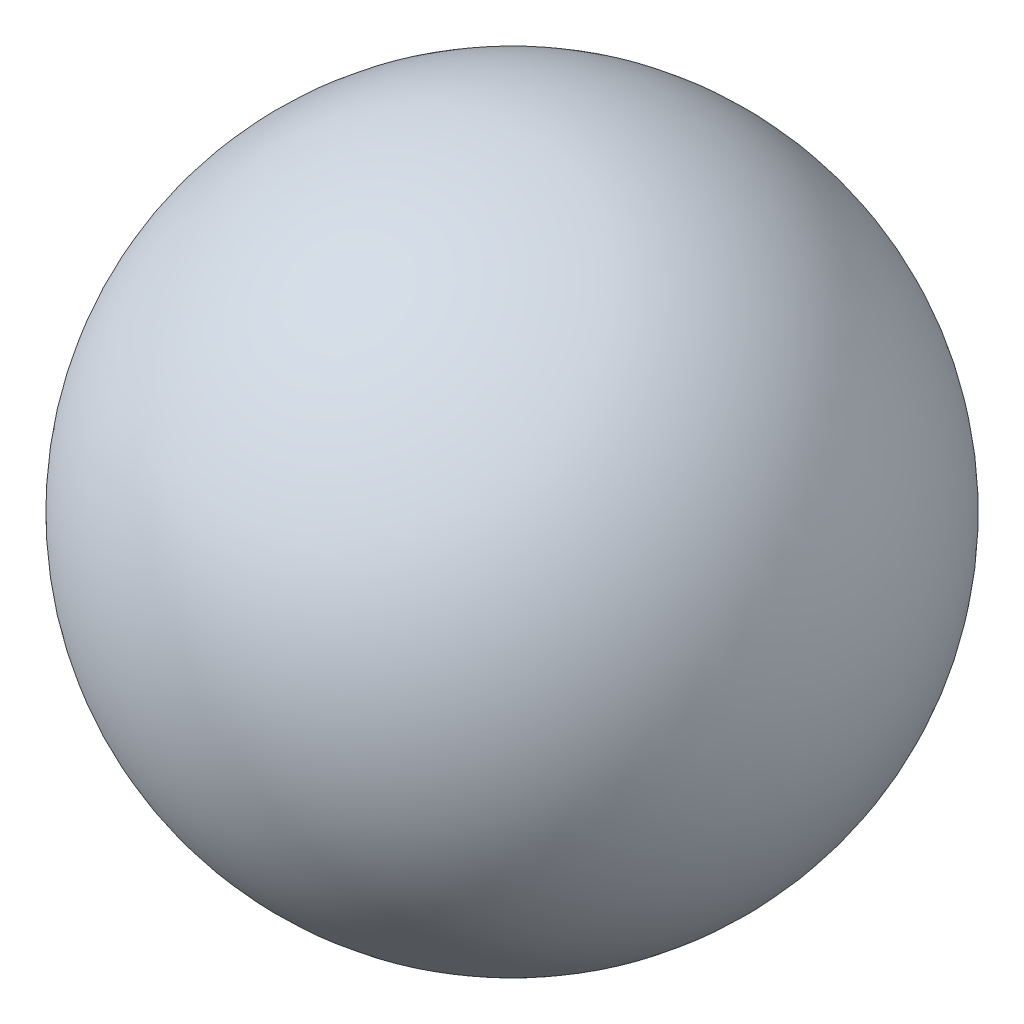
ISO-10303-21;
HEADER;
FILE_DESCRIPTION(('STEP AP214'),'2;1');
FILE_NAME('part.step','',(''),(''),'','','');
FILE_SCHEMA(('AUTOMOTIVE_DESIGN { 1 0 10303 214 1 1 1 1 }'));
ENDSEC;
DATA;
#1=APPLICATION_CONTEXT('core data for automotive mechanical design processes');
#2=APPLICATION_PROTOCOL_DEFINITION('international standard','automotive_design',2000,#1);
#3=PRODUCT_CONTEXT('',#1,'mechanical');
#4=PRODUCT('Part','Part','',(#3));
#5=PRODUCT_RELATED_PRODUCT_CATEGORY('part','',(#4));
#6=PRODUCT_DEFINITION_FORMATION('','',#4);
#7=PRODUCT_DEFINITION_CONTEXT('part definition',#1,'design');
#8=PRODUCT_DEFINITION('design','',#6,#7);
#9=PRODUCT_DEFINITION_SHAPE('','',#8);
#10=(LENGTH_UNIT() NAMED_UNIT(*) SI_UNIT(.MILLI.,.METRE.));
#11=(NAMED_UNIT(*) PLANE_ANGLE_UNIT() SI_UNIT($,.RADIAN.));
#12=(NAMED_UNIT(*) SI_UNIT($,.STERADIAN.) SOLID_ANGLE_UNIT());
#13=UNCERTAINTY_MEASURE_WITH_UNIT(LENGTH_MEASURE(1.E-05),#10,'distance_accuracy_value','');
#14=(GEOMETRIC_REPRESENTATION_CONTEXT(3) GLOBAL_UNCERTAINTY_ASSIGNED_CONTEXT((#13)) GLOBAL_UNIT_ASSIGNED_CONTEXT((#10,
#11,#12)) REPRESENTATION_CONTEXT('',''));
#15=CARTESIAN_POINT('',(0.,0.,0.));
#16=DIRECTION('',(0.,0.,1.));
#17=DIRECTION('',(1.,0.,0.));
#18=AXIS2_PLACEMENT_3D('',#15,#16,#17);
#19=CARTESIAN_POINT('',(0.,0.,0.));
#20=DIRECTION('',(0.,1.,0.));
#21=DIRECTION('',(1.,0.,0.));
#22=AXIS2_PLACEMENT_3D('',#19,#20,#21);
#23=SPHERICAL_SURFACE('',#22,25.4);
#24=CARTESIAN_POINT('',(0.,25.4,0.));
#25=VERTEX_POINT('',#24);
#26=VERTEX_LOOP('',#25);
#27=FACE_BOUND('',#26,.T.);
#28=ADVANCED_FACE('F32',(#27),#23,.T.);
#29=CLOSED_SHELL('',(#28));
#30=CARTESIAN_POINT('',(0.,0.,0.));
#31=DIRECTION('',(0.,1.,0.));
#32=DIRECTION('',(-1.,0.,0.));
#33=AXIS2_PLACEMENT_3D('',#30,#31,#32);
#34=SPHERICAL_SURFACE('',#33,22.86);
#35=CARTESIAN_POINT('',(0.,22.86,0.));
#36=VERTEX_POINT('',#35);
#37=VERTEX_LOOP('',#36);
#38=FACE_BOUND('',#37,.T.);
#39=ADVANCED_FACE('F45',(#38),#34,.F.);
#40=CLOSED_SHELL('',(#39));
#41=ORIENTED_CLOSED_SHELL('',*,#40,.T.);
#42=BREP_WITH_VOIDS('B2',#29,(#41));
#43=ADVANCED_BREP_SHAPE_REPRESENTATION('',(#18,#42),#14);
#44=SHAPE_DEFINITION_REPRESENTATION(#9,#43);
ENDSEC;
END-ISO-10303-21;
